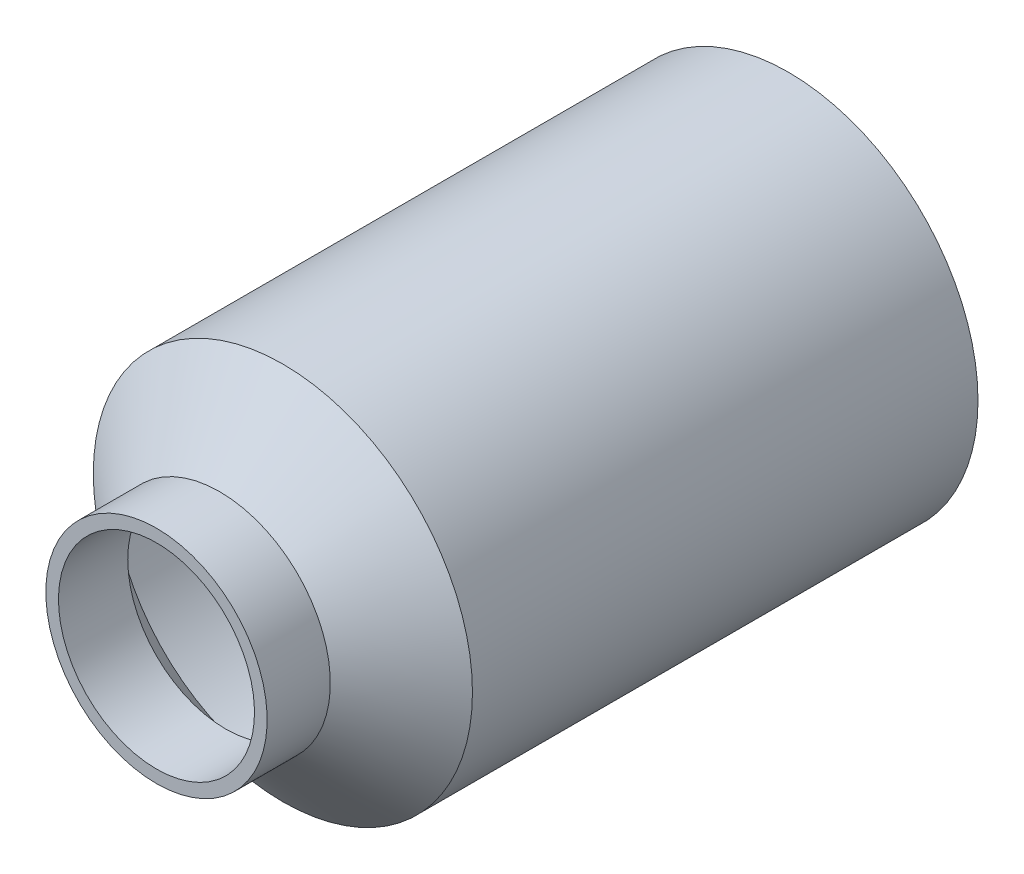
ISO-10303-21;
HEADER;
FILE_DESCRIPTION(('STEP AP214'),'2;1');
FILE_NAME('part.step','',(''),(''),'','','');
FILE_SCHEMA(('AUTOMOTIVE_DESIGN { 1 0 10303 214 1 1 1 1 }'));
ENDSEC;
DATA;
#1=APPLICATION_CONTEXT('core data for automotive mechanical design processes');
#2=APPLICATION_PROTOCOL_DEFINITION('international standard','automotive_design',2000,#1);
#3=PRODUCT_CONTEXT('',#1,'mechanical');
#4=PRODUCT('Part','Part','',(#3));
#5=PRODUCT_RELATED_PRODUCT_CATEGORY('part','',(#4));
#6=PRODUCT_DEFINITION_FORMATION('','',#4);
#7=PRODUCT_DEFINITION_CONTEXT('part definition',#1,'design');
#8=PRODUCT_DEFINITION('design','',#6,#7);
#9=PRODUCT_DEFINITION_SHAPE('','',#8);
#10=(LENGTH_UNIT() NAMED_UNIT(*) SI_UNIT(.MILLI.,.METRE.));
#11=(NAMED_UNIT(*) PLANE_ANGLE_UNIT() SI_UNIT($,.RADIAN.));
#12=(NAMED_UNIT(*) SI_UNIT($,.STERADIAN.) SOLID_ANGLE_UNIT());
#13=UNCERTAINTY_MEASURE_WITH_UNIT(LENGTH_MEASURE(1.E-05),#10,'distance_accuracy_value','');
#14=(GEOMETRIC_REPRESENTATION_CONTEXT(3) GLOBAL_UNCERTAINTY_ASSIGNED_CONTEXT((#13)) GLOBAL_UNIT_ASSIGNED_CONTEXT((#10,
#11,#12)) REPRESENTATION_CONTEXT('',''));
#15=CARTESIAN_POINT('',(0.,0.,0.));
#16=DIRECTION('',(0.,0.,1.));
#17=DIRECTION('',(1.,0.,0.));
#18=AXIS2_PLACEMENT_3D('',#15,#16,#17);
#19=CARTESIAN_POINT('',(0.,38.1,0.));
#20=DIRECTION('',(0.,0.,-1.));
#21=DIRECTION('',(0.,1.,0.));
#22=AXIS2_PLACEMENT_3D('',#19,#20,#21);
#23=PLANE('',#22);
#24=CARTESIAN_POINT('',(0.,38.1,0.));
#25=DIRECTION('',(0.,0.,1.));
#26=DIRECTION('',(0.,-1.,0.));
#27=AXIS2_PLACEMENT_3D('',#24,#25,#26);
#28=CIRCLE('',#27,38.1);
#29=CARTESIAN_POINT('',(0.,0.,0.));
#30=VERTEX_POINT('',#29);
#31=EDGE_CURVE('E10',#30,#30,#28,.T.);
#32=ORIENTED_EDGE('',*,*,#31,.F.);
#33=EDGE_LOOP('',(#32));
#34=FACE_BOUND('',#33,.T.);
#35=ADVANCED_FACE('F43',(#34),#23,.T.);
#36=CARTESIAN_POINT('',(0.,38.1,127.));
#37=DIRECTION('',(0.,0.,1.));
#38=DIRECTION('',(0.,-1.,0.));
#39=AXIS2_PLACEMENT_3D('',#36,#37,#38);
#40=CYLINDRICAL_SURFACE('',#39,38.1);
#41=ORIENTED_EDGE('',*,*,#31,.T.);
#42=EDGE_LOOP('',(#41));
#43=FACE_BOUND('',#42,.T.);
#44=CARTESIAN_POINT('',(0.,38.1,101.6));
#45=DIRECTION('',(0.,0.,1.));
#46=DIRECTION('',(0.,-1.,0.));
#47=AXIS2_PLACEMENT_3D('',#44,#45,#46);
#48=CIRCLE('',#47,38.1);
#49=CARTESIAN_POINT('',(0.,0.,101.6));
#50=VERTEX_POINT('',#49);
#51=EDGE_CURVE('E50',#50,#50,#48,.T.);
#52=ORIENTED_EDGE('',*,*,#51,.F.);
#53=EDGE_LOOP('',(#52));
#54=FACE_BOUND('',#53,.T.);
#55=ADVANCED_FACE('F117',(#43,#54),#40,.T.);
#56=CARTESIAN_POINT('',(0.,38.1,114.3));
#57=DIRECTION('',(0.,0.,-1.));
#58=DIRECTION('',(0.,1.,0.));
#59=AXIS2_PLACEMENT_3D('',#56,#57,#58);
#60=CONICAL_SURFACE('',#59,22.237705084068,0.895664793857865);
#61=ORIENTED_EDGE('',*,*,#51,.T.);
#62=EDGE_LOOP('',(#61));
#63=FACE_BOUND('',#62,.T.);
#64=CARTESIAN_POINT('',(0.,38.1,114.3));
#65=DIRECTION('',(0.,0.,1.));
#66=DIRECTION('',(0.,-1.,0.));
#67=AXIS2_PLACEMENT_3D('',#64,#65,#66);
#68=CIRCLE('',#67,22.2377050840681);
#69=CARTESIAN_POINT('',(0.,15.8622949159319,114.3));
#70=VERTEX_POINT('',#69);
#71=EDGE_CURVE('E55',#70,#70,#68,.T.);
#72=ORIENTED_EDGE('',*,*,#71,.F.);
#73=EDGE_LOOP('',(#72));
#74=FACE_BOUND('',#73,.T.);
#75=ADVANCED_FACE('F111',(#63,#74),#60,.T.);
#76=CARTESIAN_POINT('',(0.,38.1,127.));
#77=DIRECTION('',(0.,0.,1.));
#78=DIRECTION('',(0.,-1.,0.));
#79=AXIS2_PLACEMENT_3D('',#76,#77,#78);
#80=CYLINDRICAL_SURFACE('',#79,22.237705084068);
#81=ORIENTED_EDGE('',*,*,#71,.T.);
#82=EDGE_LOOP('',(#81));
#83=FACE_BOUND('',#82,.T.);
#84=CARTESIAN_POINT('',(0.,38.1,127.));
#85=DIRECTION('',(0.,0.,1.));
#86=DIRECTION('',(0.,-1.,0.));
#87=AXIS2_PLACEMENT_3D('',#84,#85,#86);
#88=CIRCLE('',#87,22.237705084068);
#89=CARTESIAN_POINT('',(0.,15.8622949159319,127.));
#90=VERTEX_POINT('',#89);
#91=EDGE_CURVE('E60',#90,#90,#88,.T.);
#92=ORIENTED_EDGE('',*,*,#91,.F.);
#93=EDGE_LOOP('',(#92));
#94=FACE_BOUND('',#93,.T.);
#95=ADVANCED_FACE('F106',(#83,#94),#80,.T.);
#96=CARTESIAN_POINT('',(0.,15.8622949159319,127.));
#97=DIRECTION('',(0.,0.,1.));
#98=DIRECTION('',(0.,-1.,0.));
#99=AXIS2_PLACEMENT_3D('',#96,#97,#98);
#100=PLANE('',#99);
#101=CARTESIAN_POINT('',(0.,38.1,127.));
#102=DIRECTION('',(0.,0.,1.));
#103=DIRECTION('',(0.,-1.,0.));
#104=AXIS2_PLACEMENT_3D('',#101,#102,#103);
#105=CIRCLE('',#104,19.697705084068);
#106=CARTESIAN_POINT('',(0.,18.4022949159319,127.));
#107=VERTEX_POINT('',#106);
#108=EDGE_CURVE('E67',#107,#107,#105,.T.);
#109=ORIENTED_EDGE('',*,*,#108,.F.);
#110=EDGE_LOOP('',(#109));
#111=FACE_BOUND('',#110,.T.);
#112=ORIENTED_EDGE('',*,*,#91,.T.);
#113=EDGE_LOOP('',(#112));
#114=FACE_BOUND('',#113,.T.);
#115=ADVANCED_FACE('F103',(#111,#114),#100,.T.);
#116=CARTESIAN_POINT('',(0.,38.1,2.54));
#117=DIRECTION('',(0.,0.,-1.));
#118=DIRECTION('',(0.,1.,0.));
#119=AXIS2_PLACEMENT_3D('',#116,#117,#118);
#120=PLANE('',#119);
#121=CARTESIAN_POINT('',(0.,38.1,2.54));
#122=DIRECTION('',(0.,0.,-1.));
#123=DIRECTION('',(0.,1.,0.));
#124=AXIS2_PLACEMENT_3D('',#121,#122,#123);
#125=CIRCLE('',#124,35.56);
#126=CARTESIAN_POINT('',(0.,73.66,2.54000000000001));
#127=VERTEX_POINT('',#126);
#128=EDGE_CURVE('E66',#127,#127,#125,.F.);
#129=ORIENTED_EDGE('',*,*,#128,.T.);
#130=EDGE_LOOP('',(#129));
#131=FACE_BOUND('',#130,.T.);
#132=ADVANCED_FACE('F83',(#131),#120,.F.);
#133=CARTESIAN_POINT('',(0.,38.1,127.));
#134=DIRECTION('',(0.,0.,1.));
#135=DIRECTION('',(0.,-1.,0.));
#136=AXIS2_PLACEMENT_3D('',#133,#134,#135);
#137=CYLINDRICAL_SURFACE('',#136,35.56);
#138=ORIENTED_EDGE('',*,*,#128,.F.);
#139=EDGE_LOOP('',(#138));
#140=FACE_BOUND('',#139,.T.);
#141=CARTESIAN_POINT('',(0.,38.1,100.379823468005));
#142=DIRECTION('',(0.,0.,-1.));
#143=DIRECTION('',(0.,1.,0.));
#144=AXIS2_PLACEMENT_3D('',#141,#142,#143);
#145=CIRCLE('',#144,35.56);
#146=CARTESIAN_POINT('',(0.,73.66,100.379823468005));
#147=VERTEX_POINT('',#146);
#148=EDGE_CURVE('E75',#147,#147,#145,.F.);
#149=ORIENTED_EDGE('',*,*,#148,.T.);
#150=EDGE_LOOP('',(#149));
#151=FACE_BOUND('',#150,.T.);
#152=ADVANCED_FACE('F85',(#140,#151),#137,.F.);
#153=CARTESIAN_POINT('',(0.,38.1,112.317213135509));
#154=DIRECTION('',(0.,0.,-1.));
#155=DIRECTION('',(0.,1.,0.));
#156=AXIS2_PLACEMENT_3D('',#153,#154,#155);
#157=CONICAL_SURFACE('',#156,20.650205084068,0.895664793857865);
#158=ORIENTED_EDGE('',*,*,#148,.F.);
#159=EDGE_LOOP('',(#158));
#160=FACE_BOUND('',#159,.T.);
#161=CARTESIAN_POINT('',(0.,38.1,113.079823468005));
#162=DIRECTION('',(0.,0.,-1.));
#163=DIRECTION('',(0.,1.,0.));
#164=AXIS2_PLACEMENT_3D('',#161,#162,#163);
#165=CIRCLE('',#164,19.697705084068);
#166=CARTESIAN_POINT('',(0.,57.797705084068,113.079823468005));
#167=VERTEX_POINT('',#166);
#168=EDGE_CURVE('E71',#167,#167,#165,.F.);
#169=ORIENTED_EDGE('',*,*,#168,.T.);
#170=EDGE_LOOP('',(#169));
#171=FACE_BOUND('',#170,.T.);
#172=ADVANCED_FACE('F88',(#160,#171),#157,.F.);
#173=CARTESIAN_POINT('',(0.,38.1,127.));
#174=DIRECTION('',(0.,0.,1.));
#175=DIRECTION('',(0.,-1.,0.));
#176=AXIS2_PLACEMENT_3D('',#173,#174,#175);
#177=CYLINDRICAL_SURFACE('',#176,19.697705084068);
#178=ORIENTED_EDGE('',*,*,#168,.F.);
#179=EDGE_LOOP('',(#178));
#180=FACE_BOUND('',#179,.T.);
#181=ORIENTED_EDGE('',*,*,#108,.T.);
#182=EDGE_LOOP('',(#181));
#183=FACE_BOUND('',#182,.T.);
#184=ADVANCED_FACE('F94',(#180,#183),#177,.F.);
#185=CLOSED_SHELL('',(#35,#55,#75,#95,#115,#132,#152,#172,#184));
#186=MANIFOLD_SOLID_BREP('B2',#185);
#187=ADVANCED_BREP_SHAPE_REPRESENTATION('',(#18,#186),#14);
#188=SHAPE_DEFINITION_REPRESENTATION(#9,#187);
ENDSEC;
END-ISO-10303-21;
